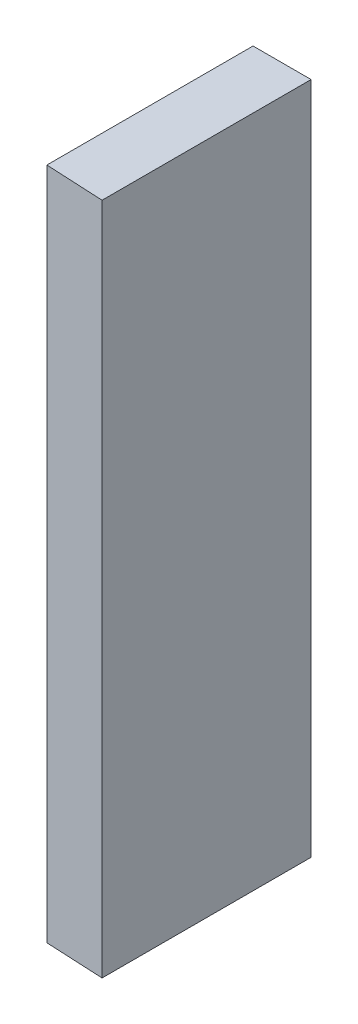
ISO-10303-21;
HEADER;
FILE_DESCRIPTION(('STEP AP214'),'2;1');
FILE_NAME('part.step','',(''),(''),'','','');
FILE_SCHEMA(('AUTOMOTIVE_DESIGN { 1 0 10303 214 1 1 1 1 }'));
ENDSEC;
DATA;
#1=APPLICATION_CONTEXT('core data for automotive mechanical design processes');
#2=APPLICATION_PROTOCOL_DEFINITION('international standard','automotive_design',2000,#1);
#3=PRODUCT_CONTEXT('',#1,'mechanical');
#4=PRODUCT('Part','Part','',(#3));
#5=PRODUCT_RELATED_PRODUCT_CATEGORY('part','',(#4));
#6=PRODUCT_DEFINITION_FORMATION('','',#4);
#7=PRODUCT_DEFINITION_CONTEXT('part definition',#1,'design');
#8=PRODUCT_DEFINITION('design','',#6,#7);
#9=PRODUCT_DEFINITION_SHAPE('','',#8);
#10=(LENGTH_UNIT() NAMED_UNIT(*) SI_UNIT(.MILLI.,.METRE.));
#11=(NAMED_UNIT(*) PLANE_ANGLE_UNIT() SI_UNIT($,.RADIAN.));
#12=(NAMED_UNIT(*) SI_UNIT($,.STERADIAN.) SOLID_ANGLE_UNIT());
#13=UNCERTAINTY_MEASURE_WITH_UNIT(LENGTH_MEASURE(1.E-05),#10,'distance_accuracy_value','');
#14=(GEOMETRIC_REPRESENTATION_CONTEXT(3) GLOBAL_UNCERTAINTY_ASSIGNED_CONTEXT((#13)) GLOBAL_UNIT_ASSIGNED_CONTEXT((#10,
#11,#12)) REPRESENTATION_CONTEXT('',''));
#15=CARTESIAN_POINT('',(0.,0.,0.));
#16=DIRECTION('',(0.,0.,1.));
#17=DIRECTION('',(1.,0.,0.));
#18=AXIS2_PLACEMENT_3D('',#15,#16,#17);
#19=CARTESIAN_POINT('',(0.,0.,18.));
#20=DIRECTION('',(1.,0.,0.));
#21=DIRECTION('',(0.,0.,-1.));
#22=AXIS2_PLACEMENT_3D('',#19,#20,#21);
#23=PLANE('',#22);
#24=DIRECTION('',(0.,0.,-1.));
#25=VECTOR('',#24,1.);
#26=CARTESIAN_POINT('',(0.,-58.,18.));
#27=LINE('',#26,#25);
#28=CARTESIAN_POINT('',(0.,-58.,17.75));
#29=VERTEX_POINT('',#28);
#30=CARTESIAN_POINT('',(0.,-58.,3.));
#31=VERTEX_POINT('',#30);
#32=EDGE_CURVE('E11',#29,#31,#27,.T.);
#33=ORIENTED_EDGE('',*,*,#32,.F.);
#34=DIRECTION('',(0.,-1.,0.));
#35=VECTOR('',#34,1.);
#36=CARTESIAN_POINT('',(0.,0.,17.75));
#37=LINE('',#36,#35);
#38=CARTESIAN_POINT('',(0.,0.,17.75));
#39=VERTEX_POINT('',#38);
#40=EDGE_CURVE('E93',#39,#29,#37,.T.);
#41=ORIENTED_EDGE('',*,*,#40,.F.);
#42=DIRECTION('',(0.,0.,-1.));
#43=VECTOR('',#42,1.);
#44=CARTESIAN_POINT('',(0.,0.,18.));
#45=LINE('',#44,#43);
#46=CARTESIAN_POINT('',(0.,0.,0.));
#47=VERTEX_POINT('',#46);
#48=EDGE_CURVE('E102',#39,#47,#45,.T.);
#49=ORIENTED_EDGE('',*,*,#48,.T.);
#50=DIRECTION('',(0.,-1.,0.));
#51=VECTOR('',#50,1.);
#52=CARTESIAN_POINT('',(0.,0.,0.));
#53=LINE('',#52,#51);
#54=CARTESIAN_POINT('',(0.,-10.25,0.));
#55=VERTEX_POINT('',#54);
#56=EDGE_CURVE('E53',#47,#55,#53,.T.);
#57=ORIENTED_EDGE('',*,*,#56,.T.);
#58=DIRECTION('',(0.,0.,-1.));
#59=VECTOR('',#58,1.);
#60=CARTESIAN_POINT('',(0.,-10.25,0.));
#61=LINE('',#60,#59);
#62=CARTESIAN_POINT('',(0.,-10.25,3.));
#63=VERTEX_POINT('',#62);
#64=EDGE_CURVE('E139',#63,#55,#61,.T.);
#65=ORIENTED_EDGE('',*,*,#64,.F.);
#66=DIRECTION('',(0.,1.,0.));
#67=VECTOR('',#66,1.);
#68=CARTESIAN_POINT('',(0.,-58.,3.));
#69=LINE('',#68,#67);
#70=EDGE_CURVE('E142',#31,#63,#69,.T.);
#71=ORIENTED_EDGE('',*,*,#70,.F.);
#72=EDGE_LOOP('',(#33,#41,#49,#57,#65,#71));
#73=FACE_BOUND('',#72,.T.);
#74=ADVANCED_FACE('F33',(#73),#23,.F.);
#75=CARTESIAN_POINT('',(0.,-58.,18.));
#76=DIRECTION('',(0.,1.,0.));
#77=DIRECTION('',(0.,0.,1.));
#78=AXIS2_PLACEMENT_3D('',#75,#76,#77);
#79=PLANE('',#78);
#80=DIRECTION('',(0.,0.,-1.));
#81=VECTOR('',#80,1.);
#82=CARTESIAN_POINT('',(5.00000000000001,-58.,18.));
#83=LINE('',#82,#81);
#84=CARTESIAN_POINT('',(5.00000000000001,-58.,18.));
#85=VERTEX_POINT('',#84);
#86=CARTESIAN_POINT('',(5.00000000000001,-58.,0.));
#87=VERTEX_POINT('',#86);
#88=EDGE_CURVE('E40',#85,#87,#83,.T.);
#89=ORIENTED_EDGE('',*,*,#88,.F.);
#90=DIRECTION('',(0.998752338877845,0.,0.0499376169438922));
#91=VECTOR('',#90,1.);
#92=CARTESIAN_POINT('',(0.,-58.,17.75));
#93=LINE('',#92,#91);
#94=EDGE_CURVE('E100',#29,#85,#93,.T.);
#95=ORIENTED_EDGE('',*,*,#94,.F.);
#96=ORIENTED_EDGE('',*,*,#32,.T.);
#97=DIRECTION('',(1.,0.,0.));
#98=VECTOR('',#97,1.);
#99=CARTESIAN_POINT('',(-10.,-58.,3.));
#100=LINE('',#99,#98);
#101=CARTESIAN_POINT('',(-10.,-58.,3.));
#102=VERTEX_POINT('',#101);
#103=EDGE_CURVE('E128',#102,#31,#100,.T.);
#104=ORIENTED_EDGE('',*,*,#103,.F.);
#105=DIRECTION('',(0.,0.,1.));
#106=VECTOR('',#105,1.);
#107=CARTESIAN_POINT('',(-10.,-58.,0.));
#108=LINE('',#107,#106);
#109=CARTESIAN_POINT('',(-10.,-58.,0.));
#110=VERTEX_POINT('',#109);
#111=EDGE_CURVE('E149',#110,#102,#108,.T.);
#112=ORIENTED_EDGE('',*,*,#111,.F.);
#113=DIRECTION('',(1.,0.,0.));
#114=VECTOR('',#113,1.);
#115=CARTESIAN_POINT('',(0.,-58.,0.));
#116=LINE('',#115,#114);
#117=EDGE_CURVE('E124',#110,#87,#116,.T.);
#118=ORIENTED_EDGE('',*,*,#117,.T.);
#119=EDGE_LOOP('',(#89,#95,#96,#104,#112,#118));
#120=FACE_BOUND('',#119,.T.);
#121=ADVANCED_FACE('F163',(#120),#79,.F.);
#122=CARTESIAN_POINT('',(5.,0.,18.));
#123=DIRECTION('',(-1.,0.,0.));
#124=DIRECTION('',(0.,-1.,0.));
#125=AXIS2_PLACEMENT_3D('',#122,#123,#124);
#126=PLANE('',#125);
#127=DIRECTION('',(0.,1.,0.));
#128=VECTOR('',#127,1.);
#129=CARTESIAN_POINT('',(5.,0.,0.));
#130=LINE('',#129,#128);
#131=CARTESIAN_POINT('',(5.,0.,0.));
#132=VERTEX_POINT('',#131);
#133=EDGE_CURVE('E120',#87,#132,#130,.T.);
#134=ORIENTED_EDGE('',*,*,#133,.T.);
#135=DIRECTION('',(0.,0.,-1.));
#136=VECTOR('',#135,1.);
#137=CARTESIAN_POINT('',(5.,0.,18.));
#138=LINE('',#137,#136);
#139=CARTESIAN_POINT('',(5.00000000000001,0.,18.));
#140=VERTEX_POINT('',#139);
#141=EDGE_CURVE('E109',#140,#132,#138,.T.);
#142=ORIENTED_EDGE('',*,*,#141,.F.);
#143=DIRECTION('',(0.,1.,0.));
#144=VECTOR('',#143,1.);
#145=CARTESIAN_POINT('',(5.,0.,18.));
#146=LINE('',#145,#144);
#147=EDGE_CURVE('E95',#85,#140,#146,.T.);
#148=ORIENTED_EDGE('',*,*,#147,.F.);
#149=ORIENTED_EDGE('',*,*,#88,.T.);
#150=EDGE_LOOP('',(#134,#142,#148,#149));
#151=FACE_BOUND('',#150,.T.);
#152=ADVANCED_FACE('F119',(#151),#126,.F.);
#153=CARTESIAN_POINT('',(0.,0.,18.));
#154=DIRECTION('',(0.,-1.,0.));
#155=DIRECTION('',(0.,0.,-1.));
#156=AXIS2_PLACEMENT_3D('',#153,#154,#155);
#157=PLANE('',#156);
#158=ORIENTED_EDGE('',*,*,#48,.F.);
#159=DIRECTION('',(0.998752338877845,0.,0.0499376169438922));
#160=VECTOR('',#159,1.);
#161=CARTESIAN_POINT('',(0.,0.,17.75));
#162=LINE('',#161,#160);
#163=EDGE_CURVE('E90',#39,#140,#162,.T.);
#164=ORIENTED_EDGE('',*,*,#163,.T.);
#165=ORIENTED_EDGE('',*,*,#141,.T.);
#166=DIRECTION('',(-1.,0.,0.));
#167=VECTOR('',#166,1.);
#168=CARTESIAN_POINT('',(0.,0.,0.));
#169=LINE('',#168,#167);
#170=EDGE_CURVE('E108',#132,#47,#169,.T.);
#171=ORIENTED_EDGE('',*,*,#170,.T.);
#172=EDGE_LOOP('',(#158,#164,#165,#171));
#173=FACE_BOUND('',#172,.T.);
#174=ADVANCED_FACE('F106',(#173),#157,.F.);
#175=CARTESIAN_POINT('',(0.,0.,0.));
#176=DIRECTION('',(0.,0.,1.));
#177=DIRECTION('',(1.,0.,0.));
#178=AXIS2_PLACEMENT_3D('',#175,#176,#177);
#179=PLANE('',#178);
#180=CARTESIAN_POINT('',(-5.,-15.,0.));
#181=DIRECTION('',(0.,0.,1.));
#182=DIRECTION('',(1.,0.,0.));
#183=AXIS2_PLACEMENT_3D('',#180,#181,#182);
#184=CIRCLE('',#183,1.625);
#185=CARTESIAN_POINT('',(-3.375,-15.,0.));
#186=VERTEX_POINT('',#185);
#187=EDGE_CURVE('E145',#186,#186,#184,.T.);
#188=ORIENTED_EDGE('',*,*,#187,.T.);
#189=EDGE_LOOP('',(#188));
#190=FACE_BOUND('',#189,.T.);
#191=CARTESIAN_POINT('',(-5.,-43.,0.));
#192=DIRECTION('',(0.,0.,1.));
#193=DIRECTION('',(1.,0.,0.));
#194=AXIS2_PLACEMENT_3D('',#191,#192,#193);
#195=CIRCLE('',#194,1.625);
#196=CARTESIAN_POINT('',(-3.375,-43.,0.));
#197=VERTEX_POINT('',#196);
#198=EDGE_CURVE('E155',#197,#197,#195,.T.);
#199=ORIENTED_EDGE('',*,*,#198,.T.);
#200=EDGE_LOOP('',(#199));
#201=FACE_BOUND('',#200,.T.);
#202=ORIENTED_EDGE('',*,*,#56,.F.);
#203=ORIENTED_EDGE('',*,*,#170,.F.);
#204=ORIENTED_EDGE('',*,*,#133,.F.);
#205=ORIENTED_EDGE('',*,*,#117,.F.);
#206=DIRECTION('',(0.,-1.,0.));
#207=VECTOR('',#206,1.);
#208=CARTESIAN_POINT('',(-10.,-58.,0.));
#209=LINE('',#208,#207);
#210=CARTESIAN_POINT('',(-10.,-10.25,0.));
#211=VERTEX_POINT('',#210);
#212=EDGE_CURVE('E141',#211,#110,#209,.T.);
#213=ORIENTED_EDGE('',*,*,#212,.F.);
#214=DIRECTION('',(1.,0.,0.));
#215=VECTOR('',#214,1.);
#216=CARTESIAN_POINT('',(-10.,-10.25,0.));
#217=LINE('',#216,#215);
#218=EDGE_CURVE('E135',#211,#55,#217,.T.);
#219=ORIENTED_EDGE('',*,*,#218,.T.);
#220=EDGE_LOOP('',(#202,#203,#204,#205,#213,#219));
#221=FACE_BOUND('',#220,.T.);
#222=ADVANCED_FACE('F122',(#190,#201,#221),#179,.F.);
#223=CARTESIAN_POINT('',(-10.,-58.,3.));
#224=DIRECTION('',(0.,0.,-1.));
#225=DIRECTION('',(-1.,0.,0.));
#226=AXIS2_PLACEMENT_3D('',#223,#224,#225);
#227=PLANE('',#226);
#228=CARTESIAN_POINT('',(-5.,-15.,3.));
#229=DIRECTION('',(0.,0.,1.));
#230=DIRECTION('',(1.,0.,0.));
#231=AXIS2_PLACEMENT_3D('',#228,#229,#230);
#232=CIRCLE('',#231,1.625);
#233=CARTESIAN_POINT('',(-3.375,-15.,3.));
#234=VERTEX_POINT('',#233);
#235=EDGE_CURVE('E158',#234,#234,#232,.T.);
#236=ORIENTED_EDGE('',*,*,#235,.F.);
#237=EDGE_LOOP('',(#236));
#238=FACE_BOUND('',#237,.T.);
#239=CARTESIAN_POINT('',(-5.,-43.,3.));
#240=DIRECTION('',(0.,0.,1.));
#241=DIRECTION('',(1.,0.,0.));
#242=AXIS2_PLACEMENT_3D('',#239,#240,#241);
#243=CIRCLE('',#242,1.625);
#244=CARTESIAN_POINT('',(-3.375,-43.,3.));
#245=VERTEX_POINT('',#244);
#246=EDGE_CURVE('E104',#245,#245,#243,.T.);
#247=ORIENTED_EDGE('',*,*,#246,.F.);
#248=EDGE_LOOP('',(#247));
#249=FACE_BOUND('',#248,.T.);
#250=ORIENTED_EDGE('',*,*,#70,.T.);
#251=DIRECTION('',(1.,0.,0.));
#252=VECTOR('',#251,1.);
#253=CARTESIAN_POINT('',(-10.,-10.25,3.));
#254=LINE('',#253,#252);
#255=CARTESIAN_POINT('',(-10.,-10.25,3.));
#256=VERTEX_POINT('',#255);
#257=EDGE_CURVE('E132',#256,#63,#254,.T.);
#258=ORIENTED_EDGE('',*,*,#257,.F.);
#259=DIRECTION('',(0.,1.,0.));
#260=VECTOR('',#259,1.);
#261=CARTESIAN_POINT('',(-10.,-58.,3.));
#262=LINE('',#261,#260);
#263=EDGE_CURVE('E147',#102,#256,#262,.T.);
#264=ORIENTED_EDGE('',*,*,#263,.F.);
#265=ORIENTED_EDGE('',*,*,#103,.T.);
#266=EDGE_LOOP('',(#250,#258,#264,#265));
#267=FACE_BOUND('',#266,.T.);
#268=ADVANCED_FACE('F175',(#238,#249,#267),#227,.F.);
#269=CARTESIAN_POINT('',(-10.,-10.25,0.));
#270=DIRECTION('',(0.,-1.,0.));
#271=DIRECTION('',(0.,0.,-1.));
#272=AXIS2_PLACEMENT_3D('',#269,#270,#271);
#273=PLANE('',#272);
#274=ORIENTED_EDGE('',*,*,#64,.T.);
#275=ORIENTED_EDGE('',*,*,#218,.F.);
#276=DIRECTION('',(0.,0.,-1.));
#277=VECTOR('',#276,1.);
#278=CARTESIAN_POINT('',(-10.,-10.25,0.));
#279=LINE('',#278,#277);
#280=EDGE_CURVE('E138',#256,#211,#279,.T.);
#281=ORIENTED_EDGE('',*,*,#280,.F.);
#282=ORIENTED_EDGE('',*,*,#257,.T.);
#283=EDGE_LOOP('',(#274,#275,#281,#282));
#284=FACE_BOUND('',#283,.T.);
#285=ADVANCED_FACE('F179',(#284),#273,.F.);
#286=CARTESIAN_POINT('',(-10.,0.,0.));
#287=DIRECTION('',(1.,0.,0.));
#288=DIRECTION('',(0.,0.,-1.));
#289=AXIS2_PLACEMENT_3D('',#286,#287,#288);
#290=PLANE('',#289);
#291=ORIENTED_EDGE('',*,*,#212,.T.);
#292=ORIENTED_EDGE('',*,*,#111,.T.);
#293=ORIENTED_EDGE('',*,*,#263,.T.);
#294=ORIENTED_EDGE('',*,*,#280,.T.);
#295=EDGE_LOOP('',(#291,#292,#293,#294));
#296=FACE_BOUND('',#295,.T.);
#297=ADVANCED_FACE('F183',(#296),#290,.F.);
#298=CARTESIAN_POINT('',(-5.,-43.,0.));
#299=DIRECTION('',(0.,0.,1.));
#300=DIRECTION('',(1.,0.,0.));
#301=AXIS2_PLACEMENT_3D('',#298,#299,#300);
#302=CYLINDRICAL_SURFACE('',#301,1.625);
#303=ORIENTED_EDGE('',*,*,#198,.F.);
#304=EDGE_LOOP('',(#303));
#305=FACE_BOUND('',#304,.T.);
#306=ORIENTED_EDGE('',*,*,#246,.T.);
#307=EDGE_LOOP('',(#306));
#308=FACE_BOUND('',#307,.T.);
#309=ADVANCED_FACE('F187',(#305,#308),#302,.F.);
#310=CARTESIAN_POINT('',(-5.,-15.,0.));
#311=DIRECTION('',(0.,0.,1.));
#312=DIRECTION('',(1.,0.,0.));
#313=AXIS2_PLACEMENT_3D('',#310,#311,#312);
#314=CYLINDRICAL_SURFACE('',#313,1.625);
#315=ORIENTED_EDGE('',*,*,#187,.F.);
#316=EDGE_LOOP('',(#315));
#317=FACE_BOUND('',#316,.T.);
#318=ORIENTED_EDGE('',*,*,#235,.T.);
#319=EDGE_LOOP('',(#318));
#320=FACE_BOUND('',#319,.T.);
#321=ADVANCED_FACE('F191',(#317,#320),#314,.F.);
#322=CARTESIAN_POINT('',(0.,0.,17.75));
#323=DIRECTION('',(0.0499376169438922,0.,-0.998752338877845));
#324=DIRECTION('',(-0.998752338877845,0.,-0.0499376169438922));
#325=AXIS2_PLACEMENT_3D('',#322,#323,#324);
#326=PLANE('',#325);
#327=ORIENTED_EDGE('',*,*,#94,.T.);
#328=ORIENTED_EDGE('',*,*,#147,.T.);
#329=ORIENTED_EDGE('',*,*,#163,.F.);
#330=ORIENTED_EDGE('',*,*,#40,.T.);
#331=EDGE_LOOP('',(#327,#328,#329,#330));
#332=FACE_BOUND('',#331,.T.);
#333=ADVANCED_FACE('F92',(#332),#326,.F.);
#334=CLOSED_SHELL('',(#74,#121,#152,#174,#222,#268,#285,#297,#309,#321,#333));
#335=MANIFOLD_SOLID_BREP('B2',#334);
#336=ADVANCED_BREP_SHAPE_REPRESENTATION('',(#18,#335),#14);
#337=SHAPE_DEFINITION_REPRESENTATION(#9,#336);
ENDSEC;
END-ISO-10303-21;
